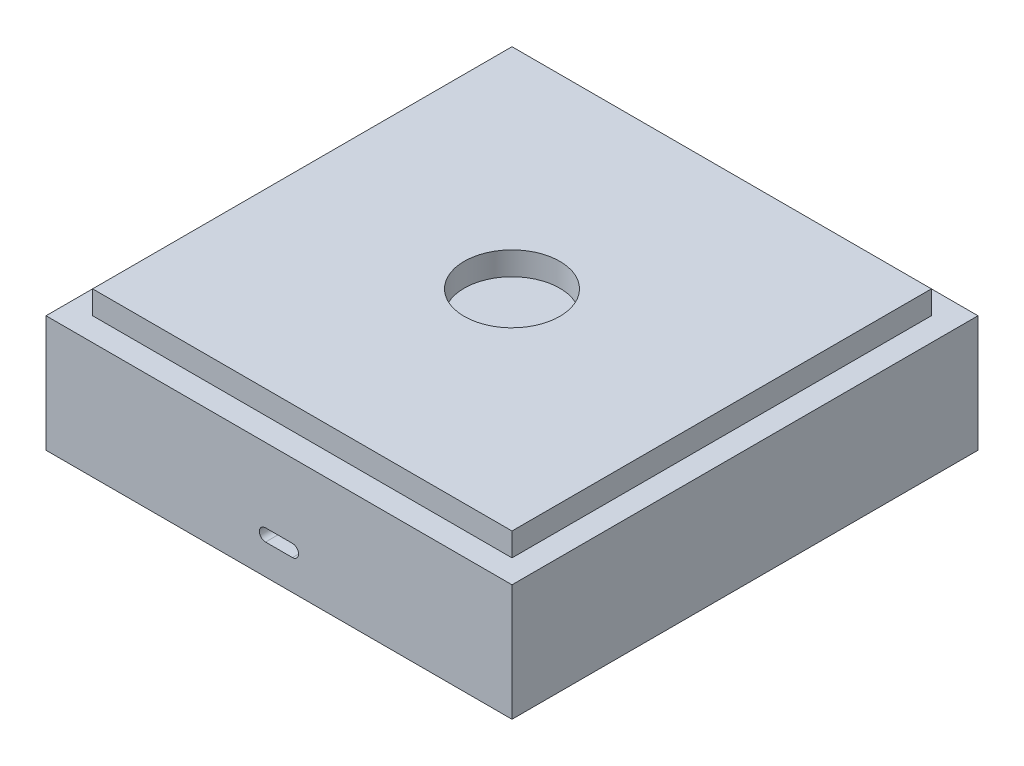
ISO-10303-21;
HEADER;
FILE_DESCRIPTION(('STEP AP214'),'2;1');
FILE_NAME('part.step','',(''),(''),'','','');
FILE_SCHEMA(('AUTOMOTIVE_DESIGN { 1 0 10303 214 1 1 1 1 }'));
ENDSEC;
DATA;
#1=APPLICATION_CONTEXT('core data for automotive mechanical design processes');
#2=APPLICATION_PROTOCOL_DEFINITION('international standard','automotive_design',2000,#1);
#3=PRODUCT_CONTEXT('',#1,'mechanical');
#4=PRODUCT('Part','Part','',(#3));
#5=PRODUCT_RELATED_PRODUCT_CATEGORY('part','',(#4));
#6=PRODUCT_DEFINITION_FORMATION('','',#4);
#7=PRODUCT_DEFINITION_CONTEXT('part definition',#1,'design');
#8=PRODUCT_DEFINITION('design','',#6,#7);
#9=PRODUCT_DEFINITION_SHAPE('','',#8);
#10=(LENGTH_UNIT() NAMED_UNIT(*) SI_UNIT(.MILLI.,.METRE.));
#11=(NAMED_UNIT(*) PLANE_ANGLE_UNIT() SI_UNIT($,.RADIAN.));
#12=(NAMED_UNIT(*) SI_UNIT($,.STERADIAN.) SOLID_ANGLE_UNIT());
#13=UNCERTAINTY_MEASURE_WITH_UNIT(LENGTH_MEASURE(1.E-05),#10,'distance_accuracy_value','');
#14=(GEOMETRIC_REPRESENTATION_CONTEXT(3) GLOBAL_UNCERTAINTY_ASSIGNED_CONTEXT((#13)) GLOBAL_UNIT_ASSIGNED_CONTEXT((#10,
#11,#12)) REPRESENTATION_CONTEXT('',''));
#15=CARTESIAN_POINT('',(0.,0.,0.));
#16=DIRECTION('',(0.,0.,1.));
#17=DIRECTION('',(1.,0.,0.));
#18=AXIS2_PLACEMENT_3D('',#15,#16,#17);
#19=CARTESIAN_POINT('',(0.,30.,0.));
#20=DIRECTION('',(0.,1.,0.));
#21=DIRECTION('',(0.,0.,1.));
#22=AXIS2_PLACEMENT_3D('',#19,#20,#21);
#23=PLANE('',#22);
#24=DIRECTION('',(0.,0.,1.));
#25=VECTOR('',#24,1.);
#26=CARTESIAN_POINT('',(5.,30.,5.));
#27=LINE('',#26,#25);
#28=CARTESIAN_POINT('',(5.,30.,5.));
#29=VERTEX_POINT('',#28);
#30=CARTESIAN_POINT('',(5.,30.,95.));
#31=VERTEX_POINT('',#30);
#32=EDGE_CURVE('E106',#29,#31,#27,.T.);
#33=ORIENTED_EDGE('',*,*,#32,.T.);
#34=DIRECTION('',(1.,0.,0.));
#35=VECTOR('',#34,1.);
#36=CARTESIAN_POINT('',(5.,30.,95.));
#37=LINE('',#36,#35);
#38=CARTESIAN_POINT('',(95.,30.,95.));
#39=VERTEX_POINT('',#38);
#40=EDGE_CURVE('E101',#31,#39,#37,.T.);
#41=ORIENTED_EDGE('',*,*,#40,.T.);
#42=DIRECTION('',(0.,0.,-1.));
#43=VECTOR('',#42,1.);
#44=CARTESIAN_POINT('',(95.,30.,5.));
#45=LINE('',#44,#43);
#46=CARTESIAN_POINT('',(95.,30.,5.));
#47=VERTEX_POINT('',#46);
#48=EDGE_CURVE('E104',#39,#47,#45,.T.);
#49=ORIENTED_EDGE('',*,*,#48,.T.);
#50=DIRECTION('',(-1.,0.,0.));
#51=VECTOR('',#50,1.);
#52=CARTESIAN_POINT('',(5.,30.,5.));
#53=LINE('',#52,#51);
#54=EDGE_CURVE('E71',#47,#29,#53,.T.);
#55=ORIENTED_EDGE('',*,*,#54,.T.);
#56=EDGE_LOOP('',(#33,#41,#49,#55));
#57=FACE_BOUND('',#56,.T.);
#58=CARTESIAN_POINT('',(50.,30.,50.));
#59=DIRECTION('',(0.,1.,0.));
#60=DIRECTION('',(0.,0.,1.));
#61=AXIS2_PLACEMENT_3D('',#58,#59,#60);
#62=CIRCLE('',#61,10.25);
#63=CARTESIAN_POINT('',(50.,30.,60.25));
#64=VERTEX_POINT('',#63);
#65=EDGE_CURVE('E121',#64,#64,#62,.T.);
#66=ORIENTED_EDGE('',*,*,#65,.F.);
#67=EDGE_LOOP('',(#66));
#68=FACE_BOUND('',#67,.T.);
#69=ADVANCED_FACE('F54',(#57,#68),#23,.T.);
#70=CARTESIAN_POINT('',(0.,25.,0.));
#71=DIRECTION('',(0.,1.,0.));
#72=DIRECTION('',(0.,0.,1.));
#73=AXIS2_PLACEMENT_3D('',#70,#71,#72);
#74=PLANE('',#73);
#75=DIRECTION('',(0.,0.,1.));
#76=VECTOR('',#75,1.);
#77=CARTESIAN_POINT('',(5.,25.,5.));
#78=LINE('',#77,#76);
#79=CARTESIAN_POINT('',(5.,25.,5.));
#80=VERTEX_POINT('',#79);
#81=CARTESIAN_POINT('',(5.,25.,95.));
#82=VERTEX_POINT('',#81);
#83=EDGE_CURVE('E118',#80,#82,#78,.T.);
#84=ORIENTED_EDGE('',*,*,#83,.F.);
#85=DIRECTION('',(-1.,0.,0.));
#86=VECTOR('',#85,1.);
#87=CARTESIAN_POINT('',(5.,25.,5.));
#88=LINE('',#87,#86);
#89=CARTESIAN_POINT('',(95.,25.,5.));
#90=VERTEX_POINT('',#89);
#91=EDGE_CURVE('E94',#90,#80,#88,.T.);
#92=ORIENTED_EDGE('',*,*,#91,.F.);
#93=DIRECTION('',(0.,0.,-1.));
#94=VECTOR('',#93,1.);
#95=CARTESIAN_POINT('',(95.,25.,5.));
#96=LINE('',#95,#94);
#97=CARTESIAN_POINT('',(95.,25.,95.));
#98=VERTEX_POINT('',#97);
#99=EDGE_CURVE('E88',#98,#90,#96,.T.);
#100=ORIENTED_EDGE('',*,*,#99,.F.);
#101=DIRECTION('',(1.,0.,0.));
#102=VECTOR('',#101,1.);
#103=CARTESIAN_POINT('',(5.,25.,95.));
#104=LINE('',#103,#102);
#105=EDGE_CURVE('E110',#82,#98,#104,.T.);
#106=ORIENTED_EDGE('',*,*,#105,.F.);
#107=EDGE_LOOP('',(#84,#92,#100,#106));
#108=FACE_BOUND('',#107,.T.);
#109=CARTESIAN_POINT('',(50.,25.,50.));
#110=DIRECTION('',(0.,1.,0.));
#111=DIRECTION('',(0.,0.,1.));
#112=AXIS2_PLACEMENT_3D('',#109,#110,#111);
#113=CIRCLE('',#112,10.25);
#114=CARTESIAN_POINT('',(50.,25.,60.25));
#115=VERTEX_POINT('',#114);
#116=EDGE_CURVE('E133',#115,#115,#113,.T.);
#117=ORIENTED_EDGE('',*,*,#116,.T.);
#118=EDGE_LOOP('',(#117));
#119=FACE_BOUND('',#118,.T.);
#120=ADVANCED_FACE('F129',(#108,#119),#74,.F.);
#121=CARTESIAN_POINT('',(5.,30.,5.));
#122=DIRECTION('',(1.,0.,0.));
#123=DIRECTION('',(0.,0.,-1.));
#124=AXIS2_PLACEMENT_3D('',#121,#122,#123);
#125=PLANE('',#124);
#126=ORIENTED_EDGE('',*,*,#83,.T.);
#127=DIRECTION('',(0.,-1.,0.));
#128=VECTOR('',#127,1.);
#129=CARTESIAN_POINT('',(5.,30.,95.));
#130=LINE('',#129,#128);
#131=EDGE_CURVE('E12',#31,#82,#130,.T.);
#132=ORIENTED_EDGE('',*,*,#131,.F.);
#133=ORIENTED_EDGE('',*,*,#32,.F.);
#134=DIRECTION('',(0.,-1.,0.));
#135=VECTOR('',#134,1.);
#136=CARTESIAN_POINT('',(5.,30.,5.));
#137=LINE('',#136,#135);
#138=EDGE_CURVE('E114',#29,#80,#137,.T.);
#139=ORIENTED_EDGE('',*,*,#138,.T.);
#140=EDGE_LOOP('',(#126,#132,#133,#139));
#141=FACE_BOUND('',#140,.T.);
#142=ADVANCED_FACE('F56',(#141),#125,.F.);
#143=CARTESIAN_POINT('',(5.,30.,95.));
#144=DIRECTION('',(0.,0.,-1.));
#145=DIRECTION('',(-1.,0.,0.));
#146=AXIS2_PLACEMENT_3D('',#143,#144,#145);
#147=PLANE('',#146);
#148=ORIENTED_EDGE('',*,*,#105,.T.);
#149=DIRECTION('',(0.,-1.,0.));
#150=VECTOR('',#149,1.);
#151=CARTESIAN_POINT('',(95.,30.,95.));
#152=LINE('',#151,#150);
#153=EDGE_CURVE('E63',#39,#98,#152,.T.);
#154=ORIENTED_EDGE('',*,*,#153,.F.);
#155=ORIENTED_EDGE('',*,*,#40,.F.);
#156=ORIENTED_EDGE('',*,*,#131,.T.);
#157=EDGE_LOOP('',(#148,#154,#155,#156));
#158=FACE_BOUND('',#157,.T.);
#159=ADVANCED_FACE('F109',(#158),#147,.F.);
#160=CARTESIAN_POINT('',(95.,30.,5.));
#161=DIRECTION('',(-1.,0.,0.));
#162=DIRECTION('',(0.,0.,1.));
#163=AXIS2_PLACEMENT_3D('',#160,#161,#162);
#164=PLANE('',#163);
#165=ORIENTED_EDGE('',*,*,#99,.T.);
#166=DIRECTION('',(0.,-1.,0.));
#167=VECTOR('',#166,1.);
#168=CARTESIAN_POINT('',(95.,30.,5.));
#169=LINE('',#168,#167);
#170=EDGE_CURVE('E111',#47,#90,#169,.T.);
#171=ORIENTED_EDGE('',*,*,#170,.F.);
#172=ORIENTED_EDGE('',*,*,#48,.F.);
#173=ORIENTED_EDGE('',*,*,#153,.T.);
#174=EDGE_LOOP('',(#165,#171,#172,#173));
#175=FACE_BOUND('',#174,.T.);
#176=ADVANCED_FACE('F112',(#175),#164,.F.);
#177=CARTESIAN_POINT('',(5.,30.,5.));
#178=DIRECTION('',(0.,0.,1.));
#179=DIRECTION('',(1.,0.,0.));
#180=AXIS2_PLACEMENT_3D('',#177,#178,#179);
#181=PLANE('',#180);
#182=ORIENTED_EDGE('',*,*,#91,.T.);
#183=ORIENTED_EDGE('',*,*,#138,.F.);
#184=ORIENTED_EDGE('',*,*,#54,.F.);
#185=ORIENTED_EDGE('',*,*,#170,.T.);
#186=EDGE_LOOP('',(#182,#183,#184,#185));
#187=FACE_BOUND('',#186,.T.);
#188=ADVANCED_FACE('F126',(#187),#181,.F.);
#189=CARTESIAN_POINT('',(50.,30.,50.));
#190=DIRECTION('',(0.,-1.,0.));
#191=DIRECTION('',(0.,0.,-1.));
#192=AXIS2_PLACEMENT_3D('',#189,#190,#191);
#193=CYLINDRICAL_SURFACE('',#192,10.25);
#194=ORIENTED_EDGE('',*,*,#65,.T.);
#195=EDGE_LOOP('',(#194));
#196=FACE_BOUND('',#195,.T.);
#197=ORIENTED_EDGE('',*,*,#116,.F.);
#198=EDGE_LOOP('',(#197));
#199=FACE_BOUND('',#198,.T.);
#200=ADVANCED_FACE('F139',(#196,#199),#193,.F.);
#201=CLOSED_SHELL('',(#69,#120,#142,#159,#176,#188,#200));
#202=MANIFOLD_SOLID_BREP('B2',#201);
#203=CARTESIAN_POINT('',(0.,25.,95.));
#204=DIRECTION('',(0.,0.,-1.));
#205=DIRECTION('',(-1.,0.,0.));
#206=AXIS2_PLACEMENT_3D('',#203,#204,#205);
#207=PLANE('',#206);
#208=DIRECTION('',(1.,0.,0.));
#209=VECTOR('',#208,1.);
#210=CARTESIAN_POINT('',(0.,5.,95.));
#211=LINE('',#210,#209);
#212=CARTESIAN_POINT('',(5.,5.,95.));
#213=VERTEX_POINT('',#212);
#214=CARTESIAN_POINT('',(95.,5.,95.));
#215=VERTEX_POINT('',#214);
#216=EDGE_CURVE('E324',#213,#215,#211,.T.);
#217=ORIENTED_EDGE('',*,*,#216,.F.);
#218=DIRECTION('',(0.,-1.,0.));
#219=VECTOR('',#218,1.);
#220=CARTESIAN_POINT('',(5.,25.,95.));
#221=LINE('',#220,#219);
#222=CARTESIAN_POINT('',(5.,25.,95.));
#223=VERTEX_POINT('',#222);
#224=EDGE_CURVE('E207',#223,#213,#221,.T.);
#225=ORIENTED_EDGE('',*,*,#224,.F.);
#226=DIRECTION('',(1.,0.,0.));
#227=VECTOR('',#226,1.);
#228=CARTESIAN_POINT('',(0.,25.,95.));
#229=LINE('',#228,#227);
#230=CARTESIAN_POINT('',(95.,25.,95.));
#231=VERTEX_POINT('',#230);
#232=EDGE_CURVE('E348',#223,#231,#229,.T.);
#233=ORIENTED_EDGE('',*,*,#232,.T.);
#234=DIRECTION('',(0.,-1.,0.));
#235=VECTOR('',#234,1.);
#236=CARTESIAN_POINT('',(95.,25.,95.));
#237=LINE('',#236,#235);
#238=EDGE_CURVE('E52',#231,#215,#237,.T.);
#239=ORIENTED_EDGE('',*,*,#238,.T.);
#240=EDGE_LOOP('',(#217,#225,#233,#239));
#241=FACE_BOUND('',#240,.T.);
#242=DIRECTION('',(-1.,0.,0.));
#243=VECTOR('',#242,1.);
#244=CARTESIAN_POINT('',(0.,9.14000000000001,95.));
#245=LINE('',#244,#243);
#246=CARTESIAN_POINT('',(52.89,9.14000000000001,95.));
#247=VERTEX_POINT('',#246);
#248=CARTESIAN_POINT('',(47.11,9.14000000000001,95.));
#249=VERTEX_POINT('',#248);
#250=EDGE_CURVE('E318',#247,#249,#245,.T.);
#251=ORIENTED_EDGE('',*,*,#250,.T.);
#252=CARTESIAN_POINT('',(47.11,7.82000000000001,95.));
#253=DIRECTION('',(0.,0.,-1.));
#254=DIRECTION('',(-1.,0.,0.));
#255=AXIS2_PLACEMENT_3D('',#252,#253,#254);
#256=CIRCLE('',#255,1.32);
#257=CARTESIAN_POINT('',(47.11,6.5,95.));
#258=VERTEX_POINT('',#257);
#259=EDGE_CURVE('E321',#249,#258,#256,.F.);
#260=ORIENTED_EDGE('',*,*,#259,.T.);
#261=DIRECTION('',(-1.,0.,0.));
#262=VECTOR('',#261,1.);
#263=CARTESIAN_POINT('',(0.,6.49999999999999,95.));
#264=LINE('',#263,#262);
#265=CARTESIAN_POINT('',(52.89,6.50000000000001,95.));
#266=VERTEX_POINT('',#265);
#267=EDGE_CURVE('E313',#266,#258,#264,.T.);
#268=ORIENTED_EDGE('',*,*,#267,.F.);
#269=CARTESIAN_POINT('',(52.89,7.82000000000001,95.));
#270=DIRECTION('',(0.,0.,-1.));
#271=DIRECTION('',(-1.,0.,0.));
#272=AXIS2_PLACEMENT_3D('',#269,#270,#271);
#273=CIRCLE('',#272,1.32);
#274=EDGE_CURVE('E295',#247,#266,#273,.T.);
#275=ORIENTED_EDGE('',*,*,#274,.F.);
#276=EDGE_LOOP('',(#251,#260,#268,#275));
#277=FACE_BOUND('',#276,.T.);
#278=ADVANCED_FACE('F198',(#241,#277),#207,.T.);
#279=CARTESIAN_POINT('',(0.,25.,100.));
#280=DIRECTION('',(0.,0.,-1.));
#281=DIRECTION('',(-1.,0.,0.));
#282=AXIS2_PLACEMENT_3D('',#279,#280,#281);
#283=PLANE('',#282);
#284=DIRECTION('',(1.,0.,0.));
#285=VECTOR('',#284,1.);
#286=CARTESIAN_POINT('',(0.,0.,100.));
#287=LINE('',#286,#285);
#288=CARTESIAN_POINT('',(0.,0.,100.));
#289=VERTEX_POINT('',#288);
#290=CARTESIAN_POINT('',(100.,0.,100.));
#291=VERTEX_POINT('',#290);
#292=EDGE_CURVE('E333',#289,#291,#287,.T.);
#293=ORIENTED_EDGE('',*,*,#292,.T.);
#294=DIRECTION('',(0.,-1.,0.));
#295=VECTOR('',#294,1.);
#296=CARTESIAN_POINT('',(100.,25.,100.));
#297=LINE('',#296,#295);
#298=CARTESIAN_POINT('',(100.,25.,100.));
#299=VERTEX_POINT('',#298);
#300=EDGE_CURVE('E202',#299,#291,#297,.T.);
#301=ORIENTED_EDGE('',*,*,#300,.F.);
#302=DIRECTION('',(1.,0.,0.));
#303=VECTOR('',#302,1.);
#304=CARTESIAN_POINT('',(0.,25.,100.));
#305=LINE('',#304,#303);
#306=CARTESIAN_POINT('',(0.,25.,100.));
#307=VERTEX_POINT('',#306);
#308=EDGE_CURVE('E334',#307,#299,#305,.T.);
#309=ORIENTED_EDGE('',*,*,#308,.F.);
#310=DIRECTION('',(0.,-1.,0.));
#311=VECTOR('',#310,1.);
#312=CARTESIAN_POINT('',(0.,25.,100.));
#313=LINE('',#312,#311);
#314=EDGE_CURVE('E356',#307,#289,#313,.T.);
#315=ORIENTED_EDGE('',*,*,#314,.T.);
#316=EDGE_LOOP('',(#293,#301,#309,#315));
#317=FACE_BOUND('',#316,.T.);
#318=CARTESIAN_POINT('',(47.11,7.82000000000001,100.));
#319=DIRECTION('',(0.,0.,1.));
#320=DIRECTION('',(1.,0.,0.));
#321=AXIS2_PLACEMENT_3D('',#318,#319,#320);
#322=CIRCLE('',#321,1.32);
#323=CARTESIAN_POINT('',(47.11,6.50000000000001,100.));
#324=VERTEX_POINT('',#323);
#325=CARTESIAN_POINT('',(47.11,9.14000000000001,100.));
#326=VERTEX_POINT('',#325);
#327=EDGE_CURVE('E223',#324,#326,#322,.F.);
#328=ORIENTED_EDGE('',*,*,#327,.T.);
#329=DIRECTION('',(1.,0.,0.));
#330=VECTOR('',#329,1.);
#331=CARTESIAN_POINT('',(0.,9.14000000000001,100.));
#332=LINE('',#331,#330);
#333=CARTESIAN_POINT('',(52.89,9.14000000000001,100.));
#334=VERTEX_POINT('',#333);
#335=EDGE_CURVE('E306',#326,#334,#332,.T.);
#336=ORIENTED_EDGE('',*,*,#335,.T.);
#337=CARTESIAN_POINT('',(52.89,7.82000000000001,100.));
#338=DIRECTION('',(0.,0.,1.));
#339=DIRECTION('',(1.,0.,0.));
#340=AXIS2_PLACEMENT_3D('',#337,#338,#339);
#341=CIRCLE('',#340,1.32);
#342=CARTESIAN_POINT('',(52.89,6.50000000000001,100.));
#343=VERTEX_POINT('',#342);
#344=EDGE_CURVE('E292',#343,#334,#341,.T.);
#345=ORIENTED_EDGE('',*,*,#344,.F.);
#346=DIRECTION('',(1.,0.,0.));
#347=VECTOR('',#346,1.);
#348=CARTESIAN_POINT('',(0.,6.49999999999999,100.));
#349=LINE('',#348,#347);
#350=EDGE_CURVE('E301',#324,#343,#349,.T.);
#351=ORIENTED_EDGE('',*,*,#350,.F.);
#352=EDGE_LOOP('',(#328,#336,#345,#351));
#353=FACE_BOUND('',#352,.T.);
#354=ADVANCED_FACE('F200',(#317,#353),#283,.F.);
#355=CARTESIAN_POINT('',(95.,25.,0.));
#356=DIRECTION('',(-1.,0.,0.));
#357=DIRECTION('',(0.,0.,1.));
#358=AXIS2_PLACEMENT_3D('',#355,#356,#357);
#359=PLANE('',#358);
#360=DIRECTION('',(0.,0.,-1.));
#361=VECTOR('',#360,1.);
#362=CARTESIAN_POINT('',(95.,5.,0.));
#363=LINE('',#362,#361);
#364=CARTESIAN_POINT('',(95.,5.,5.));
#365=VERTEX_POINT('',#364);
#366=EDGE_CURVE('E326',#215,#365,#363,.T.);
#367=ORIENTED_EDGE('',*,*,#366,.F.);
#368=ORIENTED_EDGE('',*,*,#238,.F.);
#369=DIRECTION('',(0.,0.,-1.));
#370=VECTOR('',#369,1.);
#371=CARTESIAN_POINT('',(95.,25.,0.));
#372=LINE('',#371,#370);
#373=CARTESIAN_POINT('',(95.,25.,5.));
#374=VERTEX_POINT('',#373);
#375=EDGE_CURVE('E345',#231,#374,#372,.T.);
#376=ORIENTED_EDGE('',*,*,#375,.T.);
#377=DIRECTION('',(0.,-1.,0.));
#378=VECTOR('',#377,1.);
#379=CARTESIAN_POINT('',(95.,25.,5.));
#380=LINE('',#379,#378);
#381=EDGE_CURVE('E366',#374,#365,#380,.T.);
#382=ORIENTED_EDGE('',*,*,#381,.T.);
#383=EDGE_LOOP('',(#367,#368,#376,#382));
#384=FACE_BOUND('',#383,.T.);
#385=ADVANCED_FACE('F417',(#384),#359,.T.);
#386=CARTESIAN_POINT('',(5.,25.,0.));
#387=DIRECTION('',(1.,0.,0.));
#388=DIRECTION('',(0.,0.,-1.));
#389=AXIS2_PLACEMENT_3D('',#386,#387,#388);
#390=PLANE('',#389);
#391=DIRECTION('',(0.,0.,1.));
#392=VECTOR('',#391,1.);
#393=CARTESIAN_POINT('',(5.,5.,0.));
#394=LINE('',#393,#392);
#395=CARTESIAN_POINT('',(5.,5.,5.));
#396=VERTEX_POINT('',#395);
#397=EDGE_CURVE('E331',#396,#213,#394,.T.);
#398=ORIENTED_EDGE('',*,*,#397,.F.);
#399=DIRECTION('',(0.,-1.,0.));
#400=VECTOR('',#399,1.);
#401=CARTESIAN_POINT('',(5.,25.,5.));
#402=LINE('',#401,#400);
#403=CARTESIAN_POINT('',(5.,25.,5.));
#404=VERTEX_POINT('',#403);
#405=EDGE_CURVE('E369',#404,#396,#402,.T.);
#406=ORIENTED_EDGE('',*,*,#405,.F.);
#407=DIRECTION('',(0.,0.,1.));
#408=VECTOR('',#407,1.);
#409=CARTESIAN_POINT('',(5.,25.,0.));
#410=LINE('',#409,#408);
#411=EDGE_CURVE('E351',#404,#223,#410,.T.);
#412=ORIENTED_EDGE('',*,*,#411,.T.);
#413=ORIENTED_EDGE('',*,*,#224,.T.);
#414=EDGE_LOOP('',(#398,#406,#412,#413));
#415=FACE_BOUND('',#414,.T.);
#416=ADVANCED_FACE('F414',(#415),#390,.T.);
#417=CARTESIAN_POINT('',(100.,25.,0.));
#418=DIRECTION('',(1.,0.,0.));
#419=DIRECTION('',(0.,0.,-1.));
#420=AXIS2_PLACEMENT_3D('',#417,#418,#419);
#421=PLANE('',#420);
#422=DIRECTION('',(0.,0.,1.));
#423=VECTOR('',#422,1.);
#424=CARTESIAN_POINT('',(100.,0.,0.));
#425=LINE('',#424,#423);
#426=CARTESIAN_POINT('',(100.,0.,0.));
#427=VERTEX_POINT('',#426);
#428=EDGE_CURVE('E359',#427,#291,#425,.T.);
#429=ORIENTED_EDGE('',*,*,#428,.F.);
#430=DIRECTION('',(0.,-1.,0.));
#431=VECTOR('',#430,1.);
#432=CARTESIAN_POINT('',(100.,25.,0.));
#433=LINE('',#432,#431);
#434=CARTESIAN_POINT('',(100.,25.,0.));
#435=VERTEX_POINT('',#434);
#436=EDGE_CURVE('E377',#435,#427,#433,.T.);
#437=ORIENTED_EDGE('',*,*,#436,.F.);
#438=DIRECTION('',(0.,0.,1.));
#439=VECTOR('',#438,1.);
#440=CARTESIAN_POINT('',(100.,25.,0.));
#441=LINE('',#440,#439);
#442=EDGE_CURVE('E336',#435,#299,#441,.T.);
#443=ORIENTED_EDGE('',*,*,#442,.T.);
#444=ORIENTED_EDGE('',*,*,#300,.T.);
#445=EDGE_LOOP('',(#429,#437,#443,#444));
#446=FACE_BOUND('',#445,.T.);
#447=ADVANCED_FACE('F383',(#446),#421,.T.);
#448=CARTESIAN_POINT('',(0.,25.,0.));
#449=DIRECTION('',(0.,0.,-1.));
#450=DIRECTION('',(-1.,0.,0.));
#451=AXIS2_PLACEMENT_3D('',#448,#449,#450);
#452=PLANE('',#451);
#453=DIRECTION('',(1.,0.,0.));
#454=VECTOR('',#453,1.);
#455=CARTESIAN_POINT('',(0.,0.,0.));
#456=LINE('',#455,#454);
#457=CARTESIAN_POINT('',(0.,0.,0.));
#458=VERTEX_POINT('',#457);
#459=EDGE_CURVE('E362',#458,#427,#456,.T.);
#460=ORIENTED_EDGE('',*,*,#459,.F.);
#461=DIRECTION('',(0.,-1.,0.));
#462=VECTOR('',#461,1.);
#463=CARTESIAN_POINT('',(0.,25.,0.));
#464=LINE('',#463,#462);
#465=CARTESIAN_POINT('',(0.,25.,0.));
#466=VERTEX_POINT('',#465);
#467=EDGE_CURVE('E376',#466,#458,#464,.T.);
#468=ORIENTED_EDGE('',*,*,#467,.F.);
#469=DIRECTION('',(1.,0.,0.));
#470=VECTOR('',#469,1.);
#471=CARTESIAN_POINT('',(0.,25.,0.));
#472=LINE('',#471,#470);
#473=EDGE_CURVE('E340',#466,#435,#472,.T.);
#474=ORIENTED_EDGE('',*,*,#473,.T.);
#475=ORIENTED_EDGE('',*,*,#436,.T.);
#476=EDGE_LOOP('',(#460,#468,#474,#475));
#477=FACE_BOUND('',#476,.T.);
#478=ADVANCED_FACE('F392',(#477),#452,.T.);
#479=CARTESIAN_POINT('',(0.,25.,0.));
#480=DIRECTION('',(1.,0.,0.));
#481=DIRECTION('',(0.,0.,-1.));
#482=AXIS2_PLACEMENT_3D('',#479,#480,#481);
#483=PLANE('',#482);
#484=DIRECTION('',(0.,0.,1.));
#485=VECTOR('',#484,1.);
#486=CARTESIAN_POINT('',(0.,0.,0.));
#487=LINE('',#486,#485);
#488=EDGE_CURVE('E337',#458,#289,#487,.T.);
#489=ORIENTED_EDGE('',*,*,#488,.T.);
#490=ORIENTED_EDGE('',*,*,#314,.F.);
#491=DIRECTION('',(0.,0.,1.));
#492=VECTOR('',#491,1.);
#493=CARTESIAN_POINT('',(0.,25.,0.));
#494=LINE('',#493,#492);
#495=EDGE_CURVE('E343',#466,#307,#494,.T.);
#496=ORIENTED_EDGE('',*,*,#495,.F.);
#497=ORIENTED_EDGE('',*,*,#467,.T.);
#498=EDGE_LOOP('',(#489,#490,#496,#497));
#499=FACE_BOUND('',#498,.T.);
#500=ADVANCED_FACE('F396',(#499),#483,.F.);
#501=CARTESIAN_POINT('',(0.,25.,5.));
#502=DIRECTION('',(0.,0.,-1.));
#503=DIRECTION('',(-1.,0.,0.));
#504=AXIS2_PLACEMENT_3D('',#501,#502,#503);
#505=PLANE('',#504);
#506=ORIENTED_EDGE('',*,*,#405,.T.);
#507=DIRECTION('',(1.,0.,0.));
#508=VECTOR('',#507,1.);
#509=CARTESIAN_POINT('',(0.,5.,5.));
#510=LINE('',#509,#508);
#511=EDGE_CURVE('E328',#396,#365,#510,.T.);
#512=ORIENTED_EDGE('',*,*,#511,.T.);
#513=ORIENTED_EDGE('',*,*,#381,.F.);
#514=DIRECTION('',(1.,0.,0.));
#515=VECTOR('',#514,1.);
#516=CARTESIAN_POINT('',(0.,25.,5.));
#517=LINE('',#516,#515);
#518=EDGE_CURVE('E354',#404,#374,#517,.T.);
#519=ORIENTED_EDGE('',*,*,#518,.F.);
#520=EDGE_LOOP('',(#506,#512,#513,#519));
#521=FACE_BOUND('',#520,.T.);
#522=ADVANCED_FACE('F401',(#521),#505,.F.);
#523=CARTESIAN_POINT('',(0.,25.,0.));
#524=DIRECTION('',(0.,1.,0.));
#525=DIRECTION('',(0.,0.,1.));
#526=AXIS2_PLACEMENT_3D('',#523,#524,#525);
#527=PLANE('',#526);
#528=ORIENTED_EDGE('',*,*,#308,.T.);
#529=ORIENTED_EDGE('',*,*,#442,.F.);
#530=ORIENTED_EDGE('',*,*,#473,.F.);
#531=ORIENTED_EDGE('',*,*,#495,.T.);
#532=EDGE_LOOP('',(#528,#529,#530,#531));
#533=FACE_BOUND('',#532,.T.);
#534=ORIENTED_EDGE('',*,*,#375,.F.);
#535=ORIENTED_EDGE('',*,*,#232,.F.);
#536=ORIENTED_EDGE('',*,*,#411,.F.);
#537=ORIENTED_EDGE('',*,*,#518,.T.);
#538=EDGE_LOOP('',(#534,#535,#536,#537));
#539=FACE_BOUND('',#538,.T.);
#540=ADVANCED_FACE('F398',(#533,#539),#527,.T.);
#541=CARTESIAN_POINT('',(0.,0.,0.));
#542=DIRECTION('',(0.,1.,0.));
#543=DIRECTION('',(0.,0.,1.));
#544=AXIS2_PLACEMENT_3D('',#541,#542,#543);
#545=PLANE('',#544);
#546=ORIENTED_EDGE('',*,*,#292,.F.);
#547=ORIENTED_EDGE('',*,*,#488,.F.);
#548=ORIENTED_EDGE('',*,*,#459,.T.);
#549=ORIENTED_EDGE('',*,*,#428,.T.);
#550=EDGE_LOOP('',(#546,#547,#548,#549));
#551=FACE_BOUND('',#550,.T.);
#552=ADVANCED_FACE('F391',(#551),#545,.F.);
#553=CARTESIAN_POINT('',(0.,5.,0.));
#554=DIRECTION('',(0.,1.,0.));
#555=DIRECTION('',(0.,0.,1.));
#556=AXIS2_PLACEMENT_3D('',#553,#554,#555);
#557=PLANE('',#556);
#558=ORIENTED_EDGE('',*,*,#216,.T.);
#559=ORIENTED_EDGE('',*,*,#366,.T.);
#560=ORIENTED_EDGE('',*,*,#511,.F.);
#561=ORIENTED_EDGE('',*,*,#397,.T.);
#562=EDGE_LOOP('',(#558,#559,#560,#561));
#563=FACE_BOUND('',#562,.T.);
#564=ADVANCED_FACE('F419',(#563),#557,.T.);
#565=CARTESIAN_POINT('',(47.11,7.82000000000001,90.));
#566=DIRECTION('',(0.,0.,1.));
#567=DIRECTION('',(1.,0.,0.));
#568=AXIS2_PLACEMENT_3D('',#565,#566,#567);
#569=CYLINDRICAL_SURFACE('',#568,1.32);
#570=DIRECTION('',(0.,0.,1.));
#571=VECTOR('',#570,1.);
#572=CARTESIAN_POINT('',(47.11,9.14000000000001,90.));
#573=LINE('',#572,#571);
#574=EDGE_CURVE('E311',#249,#326,#573,.T.);
#575=ORIENTED_EDGE('',*,*,#574,.T.);
#576=ORIENTED_EDGE('',*,*,#327,.F.);
#577=DIRECTION('',(0.,0.,1.));
#578=VECTOR('',#577,1.);
#579=CARTESIAN_POINT('',(47.11,6.5,90.));
#580=LINE('',#579,#578);
#581=EDGE_CURVE('E298',#258,#324,#580,.T.);
#582=ORIENTED_EDGE('',*,*,#581,.F.);
#583=ORIENTED_EDGE('',*,*,#259,.F.);
#584=EDGE_LOOP('',(#575,#576,#582,#583));
#585=FACE_BOUND('',#584,.T.);
#586=ADVANCED_FACE('F421',(#585),#569,.F.);
#587=CARTESIAN_POINT('',(0.,9.14000000000001,90.));
#588=DIRECTION('',(0.,-1.,0.));
#589=DIRECTION('',(0.,0.,-1.));
#590=AXIS2_PLACEMENT_3D('',#587,#588,#589);
#591=PLANE('',#590);
#592=DIRECTION('',(0.,0.,1.));
#593=VECTOR('',#592,1.);
#594=CARTESIAN_POINT('',(52.89,9.14000000000001,90.));
#595=LINE('',#594,#593);
#596=EDGE_CURVE('E297',#247,#334,#595,.T.);
#597=ORIENTED_EDGE('',*,*,#596,.T.);
#598=ORIENTED_EDGE('',*,*,#335,.F.);
#599=ORIENTED_EDGE('',*,*,#574,.F.);
#600=ORIENTED_EDGE('',*,*,#250,.F.);
#601=EDGE_LOOP('',(#597,#598,#599,#600));
#602=FACE_BOUND('',#601,.T.);
#603=ADVANCED_FACE('F428',(#602),#591,.T.);
#604=CARTESIAN_POINT('',(52.89,7.82000000000001,90.));
#605=DIRECTION('',(0.,0.,1.));
#606=DIRECTION('',(1.,0.,0.));
#607=AXIS2_PLACEMENT_3D('',#604,#605,#606);
#608=CYLINDRICAL_SURFACE('',#607,1.32);
#609=ORIENTED_EDGE('',*,*,#274,.T.);
#610=DIRECTION('',(0.,0.,1.));
#611=VECTOR('',#610,1.);
#612=CARTESIAN_POINT('',(52.89,6.50000000000001,90.));
#613=LINE('',#612,#611);
#614=EDGE_CURVE('E215',#266,#343,#613,.T.);
#615=ORIENTED_EDGE('',*,*,#614,.T.);
#616=ORIENTED_EDGE('',*,*,#344,.T.);
#617=ORIENTED_EDGE('',*,*,#596,.F.);
#618=EDGE_LOOP('',(#609,#615,#616,#617));
#619=FACE_BOUND('',#618,.T.);
#620=ADVANCED_FACE('F289',(#619),#608,.F.);
#621=CARTESIAN_POINT('',(0.,6.49999999999999,90.));
#622=DIRECTION('',(0.,-1.,0.));
#623=DIRECTION('',(1.,0.,0.));
#624=AXIS2_PLACEMENT_3D('',#621,#622,#623);
#625=PLANE('',#624);
#626=ORIENTED_EDGE('',*,*,#267,.T.);
#627=ORIENTED_EDGE('',*,*,#581,.T.);
#628=ORIENTED_EDGE('',*,*,#350,.T.);
#629=ORIENTED_EDGE('',*,*,#614,.F.);
#630=EDGE_LOOP('',(#626,#627,#628,#629));
#631=FACE_BOUND('',#630,.T.);
#632=ADVANCED_FACE('F302',(#631),#625,.F.);
#633=CLOSED_SHELL('',(#278,#354,#385,#416,#447,#478,#500,#522,#540,#552,#564,#586,#603,#620,#632));
#634=MANIFOLD_SOLID_BREP('B6',#633);
#635=ADVANCED_BREP_SHAPE_REPRESENTATION('',(#18,#202,#634),#14);
#636=SHAPE_DEFINITION_REPRESENTATION(#9,#635);
ENDSEC;
END-ISO-10303-21;
